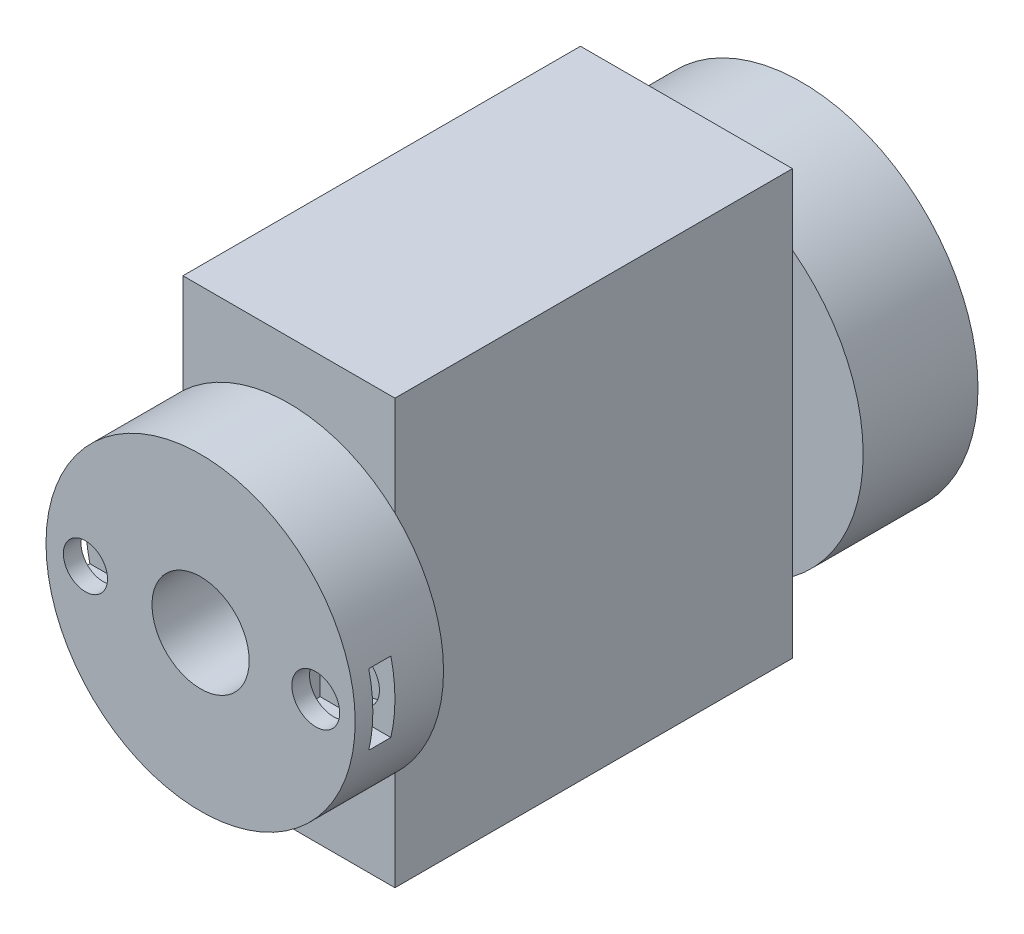
ISO-10303-21;
HEADER;
FILE_DESCRIPTION(('STEP AP214'),'2;1');
FILE_NAME('part.step','',(''),(''),'','','');
FILE_SCHEMA(('AUTOMOTIVE_DESIGN { 1 0 10303 214 1 1 1 1 }'));
ENDSEC;
DATA;
#1=APPLICATION_CONTEXT('core data for automotive mechanical design processes');
#2=APPLICATION_PROTOCOL_DEFINITION('international standard','automotive_design',2000,#1);
#3=PRODUCT_CONTEXT('',#1,'mechanical');
#4=PRODUCT('Part','Part','',(#3));
#5=PRODUCT_RELATED_PRODUCT_CATEGORY('part','',(#4));
#6=PRODUCT_DEFINITION_FORMATION('','',#4);
#7=PRODUCT_DEFINITION_CONTEXT('part definition',#1,'design');
#8=PRODUCT_DEFINITION('design','',#6,#7);
#9=PRODUCT_DEFINITION_SHAPE('','',#8);
#10=(LENGTH_UNIT() NAMED_UNIT(*) SI_UNIT(.MILLI.,.METRE.));
#11=(NAMED_UNIT(*) PLANE_ANGLE_UNIT() SI_UNIT($,.RADIAN.));
#12=(NAMED_UNIT(*) SI_UNIT($,.STERADIAN.) SOLID_ANGLE_UNIT());
#13=UNCERTAINTY_MEASURE_WITH_UNIT(LENGTH_MEASURE(1.E-05),#10,'distance_accuracy_value','');
#14=(GEOMETRIC_REPRESENTATION_CONTEXT(3) GLOBAL_UNCERTAINTY_ASSIGNED_CONTEXT((#13)) GLOBAL_UNIT_ASSIGNED_CONTEXT((#10,
#11,#12)) REPRESENTATION_CONTEXT('',''));
#15=CARTESIAN_POINT('',(0.,0.,0.));
#16=DIRECTION('',(0.,0.,1.));
#17=DIRECTION('',(1.,0.,0.));
#18=AXIS2_PLACEMENT_3D('',#15,#16,#17);
#19=CARTESIAN_POINT('',(0.,0.,-45.));
#20=DIRECTION('',(0.,0.,1.));
#21=DIRECTION('',(1.,0.,0.));
#22=AXIS2_PLACEMENT_3D('',#19,#20,#21);
#23=PLANE('',#22);
#24=CARTESIAN_POINT('',(0.,0.,-45.));
#25=DIRECTION('',(0.,0.,-1.));
#26=DIRECTION('',(-1.,0.,0.));
#27=AXIS2_PLACEMENT_3D('',#24,#25,#26);
#28=CIRCLE('',#27,20.);
#29=CARTESIAN_POINT('',(-12.,16.,-45.));
#30=VERTEX_POINT('',#29);
#31=CARTESIAN_POINT('',(12.,16.,-45.));
#32=VERTEX_POINT('',#31);
#33=EDGE_CURVE('E51',#30,#32,#28,.T.);
#34=ORIENTED_EDGE('',*,*,#33,.F.);
#35=DIRECTION('',(0.,1.,0.));
#36=VECTOR('',#35,1.);
#37=CARTESIAN_POINT('',(-12.,24.,-45.));
#38=LINE('',#37,#36);
#39=CARTESIAN_POINT('',(-12.,24.,-45.));
#40=VERTEX_POINT('',#39);
#41=EDGE_CURVE('E165',#30,#40,#38,.T.);
#42=ORIENTED_EDGE('',*,*,#41,.T.);
#43=DIRECTION('',(1.,0.,0.));
#44=VECTOR('',#43,1.);
#45=CARTESIAN_POINT('',(-12.,24.,-45.));
#46=LINE('',#45,#44);
#47=CARTESIAN_POINT('',(12.,24.,-45.));
#48=VERTEX_POINT('',#47);
#49=EDGE_CURVE('E162',#40,#48,#46,.T.);
#50=ORIENTED_EDGE('',*,*,#49,.T.);
#51=DIRECTION('',(0.,-1.,0.));
#52=VECTOR('',#51,1.);
#53=CARTESIAN_POINT('',(12.,24.,-45.));
#54=LINE('',#53,#52);
#55=EDGE_CURVE('E190',#48,#32,#54,.T.);
#56=ORIENTED_EDGE('',*,*,#55,.T.);
#57=EDGE_LOOP('',(#34,#42,#50,#56));
#58=FACE_BOUND('',#57,.T.);
#59=ADVANCED_FACE('F39',(#58),#23,.F.);
#60=CARTESIAN_POINT('',(0.,0.,0.));
#61=DIRECTION('',(0.,0.,1.));
#62=DIRECTION('',(1.,0.,0.));
#63=AXIS2_PLACEMENT_3D('',#60,#61,#62);
#64=PLANE('',#63);
#65=DIRECTION('',(0.,-1.,0.));
#66=VECTOR('',#65,1.);
#67=CARTESIAN_POINT('',(12.,24.,0.));
#68=LINE('',#67,#66);
#69=CARTESIAN_POINT('',(12.,12.737739202857,0.));
#70=VERTEX_POINT('',#69);
#71=CARTESIAN_POINT('',(12.,-12.737739202857,0.));
#72=VERTEX_POINT('',#71);
#73=EDGE_CURVE('E49',#70,#72,#68,.T.);
#74=ORIENTED_EDGE('',*,*,#73,.F.);
#75=CARTESIAN_POINT('',(0.,0.,0.));
#76=DIRECTION('',(0.,0.,1.));
#77=DIRECTION('',(1.,0.,0.));
#78=AXIS2_PLACEMENT_3D('',#75,#76,#77);
#79=CIRCLE('',#78,17.5);
#80=EDGE_CURVE('E319',#72,#70,#79,.T.);
#81=ORIENTED_EDGE('',*,*,#80,.F.);
#82=EDGE_LOOP('',(#74,#81));
#83=FACE_BOUND('',#82,.T.);
#84=ADVANCED_FACE('F401',(#83),#64,.F.);
#85=DIRECTION('',(0.,1.,0.));
#86=VECTOR('',#85,1.);
#87=CARTESIAN_POINT('',(-12.,24.,0.));
#88=LINE('',#87,#86);
#89=CARTESIAN_POINT('',(-12.,-12.737739202857,0.));
#90=VERTEX_POINT('',#89);
#91=CARTESIAN_POINT('',(-12.,12.737739202857,0.));
#92=VERTEX_POINT('',#91);
#93=EDGE_CURVE('E213',#90,#92,#88,.T.);
#94=ORIENTED_EDGE('',*,*,#93,.F.);
#95=EDGE_CURVE('E328',#92,#90,#79,.T.);
#96=ORIENTED_EDGE('',*,*,#95,.F.);
#97=EDGE_LOOP('',(#94,#96));
#98=FACE_BOUND('',#97,.T.);
#99=ADVANCED_FACE('F403',(#98),#64,.F.);
#100=CARTESIAN_POINT('',(13.0367250374008,0.,4.));
#101=DIRECTION('',(0.,0.,1.));
#102=DIRECTION('',(1.,0.,0.));
#103=AXIS2_PLACEMENT_3D('',#100,#101,#102);
#104=CYLINDRICAL_SURFACE('',#103,2.70753936126849);
#105=CARTESIAN_POINT('',(13.0367250374008,0.,8.));
#106=DIRECTION('',(0.,0.,-1.));
#107=DIRECTION('',(0.,1.,0.));
#108=AXIS2_PLACEMENT_3D('',#105,#106,#107);
#109=CIRCLE('',#108,2.70753936126849);
#110=CARTESIAN_POINT('',(13.0367250374008,2.70753936126848,8.));
#111=VERTEX_POINT('',#110);
#112=EDGE_CURVE('E246',#111,#111,#109,.T.);
#113=ORIENTED_EDGE('',*,*,#112,.T.);
#114=EDGE_LOOP('',(#113));
#115=FACE_BOUND('',#114,.T.);
#116=CARTESIAN_POINT('',(13.0367250374008,0.,10.));
#117=DIRECTION('',(0.,0.,1.));
#118=DIRECTION('',(1.,0.,0.));
#119=AXIS2_PLACEMENT_3D('',#116,#117,#118);
#120=CIRCLE('',#119,2.70753936126849);
#121=CARTESIAN_POINT('',(15.7442643986693,0.,10.));
#122=VERTEX_POINT('',#121);
#123=EDGE_CURVE('E235',#122,#122,#120,.T.);
#124=ORIENTED_EDGE('',*,*,#123,.T.);
#125=EDGE_LOOP('',(#124));
#126=FACE_BOUND('',#125,.T.);
#127=ADVANCED_FACE('F408',(#115,#126),#104,.F.);
#128=CARTESIAN_POINT('',(0.,0.,10.));
#129=DIRECTION('',(0.,0.,-1.));
#130=DIRECTION('',(-1.,0.,0.));
#131=AXIS2_PLACEMENT_3D('',#128,#129,#130);
#132=CYLINDRICAL_SURFACE('',#131,17.5);
#133=CARTESIAN_POINT('',(0.,0.,8.));
#134=DIRECTION('',(0.,0.,-1.));
#135=DIRECTION('',(0.,1.,0.));
#136=AXIS2_PLACEMENT_3D('',#133,#134,#135);
#137=CIRCLE('',#136,17.5);
#138=CARTESIAN_POINT('',(-17.0367250374008,-4.,8.));
#139=VERTEX_POINT('',#138);
#140=CARTESIAN_POINT('',(-17.0367250374008,4.,8.));
#141=VERTEX_POINT('',#140);
#142=EDGE_CURVE('E338',#139,#141,#137,.T.);
#143=ORIENTED_EDGE('',*,*,#142,.F.);
#144=DIRECTION('',(0.,0.,-1.));
#145=VECTOR('',#144,1.);
#146=CARTESIAN_POINT('',(-17.0367250374008,-4.,10.));
#147=LINE('',#146,#145);
#148=CARTESIAN_POINT('',(-17.0367250374008,-4.,5.5));
#149=VERTEX_POINT('',#148);
#150=EDGE_CURVE('E324',#149,#139,#147,.F.);
#151=ORIENTED_EDGE('',*,*,#150,.F.);
#152=CARTESIAN_POINT('',(0.,0.,5.5));
#153=DIRECTION('',(0.,0.,1.));
#154=DIRECTION('',(0.,-1.,0.));
#155=AXIS2_PLACEMENT_3D('',#152,#153,#154);
#156=CIRCLE('',#155,17.5);
#157=CARTESIAN_POINT('',(-17.0367250374008,4.,5.5));
#158=VERTEX_POINT('',#157);
#159=EDGE_CURVE('E331',#158,#149,#156,.T.);
#160=ORIENTED_EDGE('',*,*,#159,.F.);
#161=DIRECTION('',(0.,0.,-1.));
#162=VECTOR('',#161,1.);
#163=CARTESIAN_POINT('',(-17.0367250374008,4.,10.));
#164=LINE('',#163,#162);
#165=EDGE_CURVE('E335',#141,#158,#164,.T.);
#166=ORIENTED_EDGE('',*,*,#165,.F.);
#167=EDGE_LOOP('',(#143,#151,#160,#166));
#168=FACE_BOUND('',#167,.T.);
#169=CARTESIAN_POINT('',(0.,0.,10.));
#170=DIRECTION('',(0.,0.,1.));
#171=DIRECTION('',(1.,0.,0.));
#172=AXIS2_PLACEMENT_3D('',#169,#170,#171);
#173=CIRCLE('',#172,17.5);
#174=CARTESIAN_POINT('',(17.5,0.,10.));
#175=VERTEX_POINT('',#174);
#176=EDGE_CURVE('E320',#175,#175,#173,.T.);
#177=ORIENTED_EDGE('',*,*,#176,.F.);
#178=EDGE_LOOP('',(#177));
#179=FACE_BOUND('',#178,.T.);
#180=EDGE_CURVE('E325',#70,#92,#79,.T.);
#181=ORIENTED_EDGE('',*,*,#180,.T.);
#182=ORIENTED_EDGE('',*,*,#95,.T.);
#183=EDGE_CURVE('E391',#90,#72,#79,.T.);
#184=ORIENTED_EDGE('',*,*,#183,.T.);
#185=ORIENTED_EDGE('',*,*,#80,.T.);
#186=EDGE_LOOP('',(#181,#182,#184,#185));
#187=FACE_BOUND('',#186,.T.);
#188=CARTESIAN_POINT('',(0.,0.,8.));
#189=DIRECTION('',(0.,0.,-1.));
#190=DIRECTION('',(0.,1.,0.));
#191=AXIS2_PLACEMENT_3D('',#188,#189,#190);
#192=CIRCLE('',#191,17.5);
#193=CARTESIAN_POINT('',(17.0367250374008,4.,8.));
#194=VERTEX_POINT('',#193);
#195=CARTESIAN_POINT('',(17.0367250374008,-4.,8.));
#196=VERTEX_POINT('',#195);
#197=EDGE_CURVE('E353',#194,#196,#192,.T.);
#198=ORIENTED_EDGE('',*,*,#197,.F.);
#199=DIRECTION('',(0.,0.,-1.));
#200=VECTOR('',#199,1.);
#201=CARTESIAN_POINT('',(17.0367250374008,4.,10.));
#202=LINE('',#201,#200);
#203=CARTESIAN_POINT('',(17.0367250374008,4.,5.5));
#204=VERTEX_POINT('',#203);
#205=EDGE_CURVE('E341',#204,#194,#202,.F.);
#206=ORIENTED_EDGE('',*,*,#205,.F.);
#207=CARTESIAN_POINT('',(0.,0.,5.5));
#208=DIRECTION('',(0.,0.,1.));
#209=DIRECTION('',(0.,-1.,0.));
#210=AXIS2_PLACEMENT_3D('',#207,#208,#209);
#211=CIRCLE('',#210,17.5);
#212=CARTESIAN_POINT('',(17.0367250374008,-4.,5.5));
#213=VERTEX_POINT('',#212);
#214=EDGE_CURVE('E347',#213,#204,#211,.T.);
#215=ORIENTED_EDGE('',*,*,#214,.F.);
#216=DIRECTION('',(0.,0.,-1.));
#217=VECTOR('',#216,1.);
#218=CARTESIAN_POINT('',(17.0367250374008,-4.,10.));
#219=LINE('',#218,#217);
#220=EDGE_CURVE('E351',#196,#213,#219,.T.);
#221=ORIENTED_EDGE('',*,*,#220,.F.);
#222=EDGE_LOOP('',(#198,#206,#215,#221));
#223=FACE_BOUND('',#222,.T.);
#224=ADVANCED_FACE('F41',(#168,#179,#187,#223),#132,.T.);
#225=CARTESIAN_POINT('',(-13.0367250374008,0.,4.));
#226=DIRECTION('',(0.,0.,1.));
#227=DIRECTION('',(1.,0.,0.));
#228=AXIS2_PLACEMENT_3D('',#225,#226,#227);
#229=CYLINDRICAL_SURFACE('',#228,2.5);
#230=CARTESIAN_POINT('',(-13.0367250374008,0.,8.));
#231=DIRECTION('',(0.,0.,-1.));
#232=DIRECTION('',(0.,1.,0.));
#233=AXIS2_PLACEMENT_3D('',#230,#231,#232);
#234=CIRCLE('',#233,2.5);
#235=CARTESIAN_POINT('',(-13.0367250374008,2.5,8.));
#236=VERTEX_POINT('',#235);
#237=EDGE_CURVE('E287',#236,#236,#234,.T.);
#238=ORIENTED_EDGE('',*,*,#237,.T.);
#239=EDGE_LOOP('',(#238));
#240=FACE_BOUND('',#239,.T.);
#241=CARTESIAN_POINT('',(-13.0367250374008,0.,10.));
#242=DIRECTION('',(0.,0.,1.));
#243=DIRECTION('',(1.,0.,0.));
#244=AXIS2_PLACEMENT_3D('',#241,#242,#243);
#245=CIRCLE('',#244,2.5);
#246=CARTESIAN_POINT('',(-10.5367250374008,0.,10.));
#247=VERTEX_POINT('',#246);
#248=EDGE_CURVE('E278',#247,#247,#245,.T.);
#249=ORIENTED_EDGE('',*,*,#248,.T.);
#250=EDGE_LOOP('',(#249));
#251=FACE_BOUND('',#250,.T.);
#252=ADVANCED_FACE('F417',(#240,#251),#229,.F.);
#253=CARTESIAN_POINT('',(0.,0.,10.));
#254=DIRECTION('',(0.,0.,1.));
#255=DIRECTION('',(1.,0.,0.));
#256=AXIS2_PLACEMENT_3D('',#253,#254,#255);
#257=PLANE('',#256);
#258=CARTESIAN_POINT('',(0.,0.,10.));
#259=DIRECTION('',(0.,0.,1.));
#260=DIRECTION('',(1.,0.,0.));
#261=AXIS2_PLACEMENT_3D('',#258,#259,#260);
#262=CIRCLE('',#261,5.5);
#263=CARTESIAN_POINT('',(5.5,0.,10.));
#264=VERTEX_POINT('',#263);
#265=EDGE_CURVE('E230',#264,#264,#262,.T.);
#266=ORIENTED_EDGE('',*,*,#265,.F.);
#267=EDGE_LOOP('',(#266));
#268=FACE_BOUND('',#267,.T.);
#269=ORIENTED_EDGE('',*,*,#176,.T.);
#270=EDGE_LOOP('',(#269));
#271=FACE_BOUND('',#270,.T.);
#272=ORIENTED_EDGE('',*,*,#248,.F.);
#273=EDGE_LOOP('',(#272));
#274=FACE_BOUND('',#273,.T.);
#275=ORIENTED_EDGE('',*,*,#123,.F.);
#276=EDGE_LOOP('',(#275));
#277=FACE_BOUND('',#276,.T.);
#278=ADVANCED_FACE('F413',(#268,#271,#274,#277),#257,.T.);
#279=CARTESIAN_POINT('',(-18.0367250374008,4.,8.));
#280=DIRECTION('',(0.,0.,-1.));
#281=DIRECTION('',(0.,1.,0.));
#282=AXIS2_PLACEMENT_3D('',#279,#280,#281);
#283=PLANE('',#282);
#284=ORIENTED_EDGE('',*,*,#237,.F.);
#285=EDGE_LOOP('',(#284));
#286=FACE_BOUND('',#285,.T.);
#287=ORIENTED_EDGE('',*,*,#142,.T.);
#288=DIRECTION('',(1.,0.,0.));
#289=VECTOR('',#288,1.);
#290=CARTESIAN_POINT('',(-18.0367250374008,4.,8.));
#291=LINE('',#290,#289);
#292=CARTESIAN_POINT('',(-9.03672503740083,4.,8.));
#293=VERTEX_POINT('',#292);
#294=EDGE_CURVE('E316',#141,#293,#291,.T.);
#295=ORIENTED_EDGE('',*,*,#294,.T.);
#296=DIRECTION('',(0.,1.,0.));
#297=VECTOR('',#296,1.);
#298=CARTESIAN_POINT('',(-9.03672503740083,4.,8.));
#299=LINE('',#298,#297);
#300=CARTESIAN_POINT('',(-9.03672503740083,-4.,8.));
#301=VERTEX_POINT('',#300);
#302=EDGE_CURVE('E291',#301,#293,#299,.T.);
#303=ORIENTED_EDGE('',*,*,#302,.F.);
#304=DIRECTION('',(1.,0.,0.));
#305=VECTOR('',#304,1.);
#306=CARTESIAN_POINT('',(-18.0367250374008,-4.,8.));
#307=LINE('',#306,#305);
#308=EDGE_CURVE('E307',#139,#301,#307,.T.);
#309=ORIENTED_EDGE('',*,*,#308,.F.);
#310=EDGE_LOOP('',(#287,#295,#303,#309));
#311=FACE_BOUND('',#310,.T.);
#312=ADVANCED_FACE('F416',(#286,#311),#283,.T.);
#313=CARTESIAN_POINT('',(-18.0367250374008,4.,8.));
#314=DIRECTION('',(0.,-1.,0.));
#315=DIRECTION('',(1.,0.,0.));
#316=AXIS2_PLACEMENT_3D('',#313,#314,#315);
#317=PLANE('',#316);
#318=ORIENTED_EDGE('',*,*,#165,.T.);
#319=DIRECTION('',(1.,0.,0.));
#320=VECTOR('',#319,1.);
#321=CARTESIAN_POINT('',(-18.0367250374008,4.,5.5));
#322=LINE('',#321,#320);
#323=CARTESIAN_POINT('',(-9.03672503740083,4.,5.5));
#324=VERTEX_POINT('',#323);
#325=EDGE_CURVE('E313',#158,#324,#322,.T.);
#326=ORIENTED_EDGE('',*,*,#325,.T.);
#327=DIRECTION('',(0.,0.,-1.));
#328=VECTOR('',#327,1.);
#329=CARTESIAN_POINT('',(-9.03672503740083,4.,8.));
#330=LINE('',#329,#328);
#331=EDGE_CURVE('E295',#293,#324,#330,.T.);
#332=ORIENTED_EDGE('',*,*,#331,.F.);
#333=ORIENTED_EDGE('',*,*,#294,.F.);
#334=EDGE_LOOP('',(#318,#326,#332,#333));
#335=FACE_BOUND('',#334,.T.);
#336=ADVANCED_FACE('F421',(#335),#317,.T.);
#337=CARTESIAN_POINT('',(-18.0367250374008,4.,5.5));
#338=DIRECTION('',(0.,0.,1.));
#339=DIRECTION('',(0.,-1.,0.));
#340=AXIS2_PLACEMENT_3D('',#337,#338,#339);
#341=PLANE('',#340);
#342=CARTESIAN_POINT('',(-13.0367250374008,0.,5.5));
#343=DIRECTION('',(0.,0.,1.));
#344=DIRECTION('',(0.,-1.,0.));
#345=AXIS2_PLACEMENT_3D('',#342,#343,#344);
#346=CIRCLE('',#345,2.5);
#347=CARTESIAN_POINT('',(-13.0367250374008,-2.5,5.5));
#348=VERTEX_POINT('',#347);
#349=EDGE_CURVE('E286',#348,#348,#346,.T.);
#350=ORIENTED_EDGE('',*,*,#349,.F.);
#351=EDGE_LOOP('',(#350));
#352=FACE_BOUND('',#351,.T.);
#353=ORIENTED_EDGE('',*,*,#159,.T.);
#354=DIRECTION('',(1.,0.,0.));
#355=VECTOR('',#354,1.);
#356=CARTESIAN_POINT('',(-18.0367250374008,-4.,5.5));
#357=LINE('',#356,#355);
#358=CARTESIAN_POINT('',(-9.03672503740083,-4.,5.5));
#359=VERTEX_POINT('',#358);
#360=EDGE_CURVE('E310',#149,#359,#357,.T.);
#361=ORIENTED_EDGE('',*,*,#360,.T.);
#362=DIRECTION('',(0.,-1.,0.));
#363=VECTOR('',#362,1.);
#364=CARTESIAN_POINT('',(-9.03672503740083,4.,5.5));
#365=LINE('',#364,#363);
#366=EDGE_CURVE('E299',#324,#359,#365,.T.);
#367=ORIENTED_EDGE('',*,*,#366,.F.);
#368=ORIENTED_EDGE('',*,*,#325,.F.);
#369=EDGE_LOOP('',(#353,#361,#367,#368));
#370=FACE_BOUND('',#369,.T.);
#371=ADVANCED_FACE('F425',(#352,#370),#341,.T.);
#372=CARTESIAN_POINT('',(-18.0367250374008,-4.,8.));
#373=DIRECTION('',(0.,1.,0.));
#374=DIRECTION('',(-1.,0.,0.));
#375=AXIS2_PLACEMENT_3D('',#372,#373,#374);
#376=PLANE('',#375);
#377=ORIENTED_EDGE('',*,*,#150,.T.);
#378=ORIENTED_EDGE('',*,*,#308,.T.);
#379=DIRECTION('',(0.,0.,1.));
#380=VECTOR('',#379,1.);
#381=CARTESIAN_POINT('',(-9.03672503740083,-4.,8.));
#382=LINE('',#381,#380);
#383=EDGE_CURVE('E303',#359,#301,#382,.T.);
#384=ORIENTED_EDGE('',*,*,#383,.F.);
#385=ORIENTED_EDGE('',*,*,#360,.F.);
#386=EDGE_LOOP('',(#377,#378,#384,#385));
#387=FACE_BOUND('',#386,.T.);
#388=ADVANCED_FACE('F429',(#387),#376,.T.);
#389=CARTESIAN_POINT('',(-9.03672503740083,0.,0.));
#390=DIRECTION('',(1.,0.,0.));
#391=DIRECTION('',(0.,1.,0.));
#392=AXIS2_PLACEMENT_3D('',#389,#390,#391);
#393=PLANE('',#392);
#394=ORIENTED_EDGE('',*,*,#302,.T.);
#395=ORIENTED_EDGE('',*,*,#331,.T.);
#396=ORIENTED_EDGE('',*,*,#366,.T.);
#397=ORIENTED_EDGE('',*,*,#383,.T.);
#398=EDGE_LOOP('',(#394,#395,#396,#397));
#399=FACE_BOUND('',#398,.T.);
#400=ADVANCED_FACE('F433',(#399),#393,.F.);
#401=CARTESIAN_POINT('',(-13.0367250374008,0.,4.));
#402=DIRECTION('',(0.,0.,1.));
#403=DIRECTION('',(1.,0.,0.));
#404=AXIS2_PLACEMENT_3D('',#401,#402,#403);
#405=PLANE('',#404);
#406=CARTESIAN_POINT('',(-13.0367250374008,0.,4.));
#407=DIRECTION('',(0.,0.,1.));
#408=DIRECTION('',(1.,0.,0.));
#409=AXIS2_PLACEMENT_3D('',#406,#407,#408);
#410=CIRCLE('',#409,2.5);
#411=CARTESIAN_POINT('',(-10.5367250374008,0.,4.));
#412=VERTEX_POINT('',#411);
#413=EDGE_CURVE('E282',#412,#412,#410,.T.);
#414=ORIENTED_EDGE('',*,*,#413,.T.);
#415=EDGE_LOOP('',(#414));
#416=FACE_BOUND('',#415,.T.);
#417=ADVANCED_FACE('F437',(#416),#405,.T.);
#418=ORIENTED_EDGE('',*,*,#349,.T.);
#419=EDGE_LOOP('',(#418));
#420=FACE_BOUND('',#419,.T.);
#421=ORIENTED_EDGE('',*,*,#413,.F.);
#422=EDGE_LOOP('',(#421));
#423=FACE_BOUND('',#422,.T.);
#424=ADVANCED_FACE('F439',(#420,#423),#229,.F.);
#425=CARTESIAN_POINT('',(18.0367250374008,4.,8.));
#426=DIRECTION('',(0.,0.,-1.));
#427=DIRECTION('',(0.,1.,0.));
#428=AXIS2_PLACEMENT_3D('',#425,#426,#427);
#429=PLANE('',#428);
#430=ORIENTED_EDGE('',*,*,#112,.F.);
#431=EDGE_LOOP('',(#430));
#432=FACE_BOUND('',#431,.T.);
#433=ORIENTED_EDGE('',*,*,#197,.T.);
#434=DIRECTION('',(-1.,0.,0.));
#435=VECTOR('',#434,1.);
#436=CARTESIAN_POINT('',(18.0367250374008,-4.,8.));
#437=LINE('',#436,#435);
#438=CARTESIAN_POINT('',(9.03672503740083,-4.,8.));
#439=VERTEX_POINT('',#438);
#440=EDGE_CURVE('E275',#196,#439,#437,.T.);
#441=ORIENTED_EDGE('',*,*,#440,.T.);
#442=DIRECTION('',(0.,-1.,0.));
#443=VECTOR('',#442,1.);
#444=CARTESIAN_POINT('',(9.03672503740083,4.,8.));
#445=LINE('',#444,#443);
#446=CARTESIAN_POINT('',(9.03672503740083,4.,8.));
#447=VERTEX_POINT('',#446);
#448=EDGE_CURVE('E250',#447,#439,#445,.T.);
#449=ORIENTED_EDGE('',*,*,#448,.F.);
#450=DIRECTION('',(-1.,0.,0.));
#451=VECTOR('',#450,1.);
#452=CARTESIAN_POINT('',(18.0367250374008,4.,8.));
#453=LINE('',#452,#451);
#454=EDGE_CURVE('E266',#194,#447,#453,.T.);
#455=ORIENTED_EDGE('',*,*,#454,.F.);
#456=EDGE_LOOP('',(#433,#441,#449,#455));
#457=FACE_BOUND('',#456,.T.);
#458=ADVANCED_FACE('F442',(#432,#457),#429,.T.);
#459=CARTESIAN_POINT('',(18.0367250374008,-4.,8.));
#460=DIRECTION('',(0.,1.,0.));
#461=DIRECTION('',(-1.,0.,0.));
#462=AXIS2_PLACEMENT_3D('',#459,#460,#461);
#463=PLANE('',#462);
#464=ORIENTED_EDGE('',*,*,#220,.T.);
#465=DIRECTION('',(-1.,0.,0.));
#466=VECTOR('',#465,1.);
#467=CARTESIAN_POINT('',(18.0367250374008,-4.,5.5));
#468=LINE('',#467,#466);
#469=CARTESIAN_POINT('',(9.03672503740083,-4.,5.5));
#470=VERTEX_POINT('',#469);
#471=EDGE_CURVE('E272',#213,#470,#468,.T.);
#472=ORIENTED_EDGE('',*,*,#471,.T.);
#473=DIRECTION('',(0.,0.,-1.));
#474=VECTOR('',#473,1.);
#475=CARTESIAN_POINT('',(9.03672503740083,-4.,8.));
#476=LINE('',#475,#474);
#477=EDGE_CURVE('E254',#439,#470,#476,.T.);
#478=ORIENTED_EDGE('',*,*,#477,.F.);
#479=ORIENTED_EDGE('',*,*,#440,.F.);
#480=EDGE_LOOP('',(#464,#472,#478,#479));
#481=FACE_BOUND('',#480,.T.);
#482=ADVANCED_FACE('F449',(#481),#463,.T.);
#483=CARTESIAN_POINT('',(18.0367250374008,4.,5.5));
#484=DIRECTION('',(0.,0.,1.));
#485=DIRECTION('',(0.,-1.,0.));
#486=AXIS2_PLACEMENT_3D('',#483,#484,#485);
#487=PLANE('',#486);
#488=CARTESIAN_POINT('',(13.0367250374008,0.,5.5));
#489=DIRECTION('',(0.,0.,1.));
#490=DIRECTION('',(0.,-1.,0.));
#491=AXIS2_PLACEMENT_3D('',#488,#489,#490);
#492=CIRCLE('',#491,2.70753936126849);
#493=CARTESIAN_POINT('',(13.0367250374008,-2.70753936126849,5.5));
#494=VERTEX_POINT('',#493);
#495=EDGE_CURVE('E43',#494,#494,#492,.T.);
#496=ORIENTED_EDGE('',*,*,#495,.F.);
#497=EDGE_LOOP('',(#496));
#498=FACE_BOUND('',#497,.T.);
#499=ORIENTED_EDGE('',*,*,#214,.T.);
#500=DIRECTION('',(-1.,0.,0.));
#501=VECTOR('',#500,1.);
#502=CARTESIAN_POINT('',(18.0367250374008,4.,5.5));
#503=LINE('',#502,#501);
#504=CARTESIAN_POINT('',(9.03672503740083,4.,5.5));
#505=VERTEX_POINT('',#504);
#506=EDGE_CURVE('E269',#204,#505,#503,.T.);
#507=ORIENTED_EDGE('',*,*,#506,.T.);
#508=DIRECTION('',(0.,1.,0.));
#509=VECTOR('',#508,1.);
#510=CARTESIAN_POINT('',(9.03672503740083,4.,5.5));
#511=LINE('',#510,#509);
#512=EDGE_CURVE('E258',#470,#505,#511,.T.);
#513=ORIENTED_EDGE('',*,*,#512,.F.);
#514=ORIENTED_EDGE('',*,*,#471,.F.);
#515=EDGE_LOOP('',(#499,#507,#513,#514));
#516=FACE_BOUND('',#515,.T.);
#517=ADVANCED_FACE('F453',(#498,#516),#487,.T.);
#518=CARTESIAN_POINT('',(18.0367250374008,4.,8.));
#519=DIRECTION('',(0.,-1.,0.));
#520=DIRECTION('',(1.,0.,0.));
#521=AXIS2_PLACEMENT_3D('',#518,#519,#520);
#522=PLANE('',#521);
#523=ORIENTED_EDGE('',*,*,#205,.T.);
#524=ORIENTED_EDGE('',*,*,#454,.T.);
#525=DIRECTION('',(0.,0.,1.));
#526=VECTOR('',#525,1.);
#527=CARTESIAN_POINT('',(9.03672503740083,4.,8.));
#528=LINE('',#527,#526);
#529=EDGE_CURVE('E262',#505,#447,#528,.T.);
#530=ORIENTED_EDGE('',*,*,#529,.F.);
#531=ORIENTED_EDGE('',*,*,#506,.F.);
#532=EDGE_LOOP('',(#523,#524,#530,#531));
#533=FACE_BOUND('',#532,.T.);
#534=ADVANCED_FACE('F457',(#533),#522,.T.);
#535=CARTESIAN_POINT('',(9.03672503740083,0.,0.));
#536=DIRECTION('',(1.,0.,0.));
#537=DIRECTION('',(0.,1.,0.));
#538=AXIS2_PLACEMENT_3D('',#535,#536,#537);
#539=PLANE('',#538);
#540=ORIENTED_EDGE('',*,*,#448,.T.);
#541=ORIENTED_EDGE('',*,*,#477,.T.);
#542=ORIENTED_EDGE('',*,*,#512,.T.);
#543=ORIENTED_EDGE('',*,*,#529,.T.);
#544=EDGE_LOOP('',(#540,#541,#542,#543));
#545=FACE_BOUND('',#544,.T.);
#546=ADVANCED_FACE('F461',(#545),#539,.T.);
#547=CARTESIAN_POINT('',(13.0367250374008,0.,4.));
#548=DIRECTION('',(0.,0.,1.));
#549=DIRECTION('',(1.,0.,0.));
#550=AXIS2_PLACEMENT_3D('',#547,#548,#549);
#551=PLANE('',#550);
#552=CARTESIAN_POINT('',(13.0367250374008,0.,4.));
#553=DIRECTION('',(0.,0.,1.));
#554=DIRECTION('',(1.,0.,0.));
#555=AXIS2_PLACEMENT_3D('',#552,#553,#554);
#556=CIRCLE('',#555,2.70753936126849);
#557=CARTESIAN_POINT('',(15.7442643986693,0.,4.));
#558=VERTEX_POINT('',#557);
#559=EDGE_CURVE('E242',#558,#558,#556,.T.);
#560=ORIENTED_EDGE('',*,*,#559,.T.);
#561=EDGE_LOOP('',(#560));
#562=FACE_BOUND('',#561,.T.);
#563=ADVANCED_FACE('F465',(#562),#551,.T.);
#564=ORIENTED_EDGE('',*,*,#495,.T.);
#565=EDGE_LOOP('',(#564));
#566=FACE_BOUND('',#565,.T.);
#567=ORIENTED_EDGE('',*,*,#559,.F.);
#568=EDGE_LOOP('',(#567));
#569=FACE_BOUND('',#568,.T.);
#570=ADVANCED_FACE('F467',(#566,#569),#104,.F.);
#571=CARTESIAN_POINT('',(0.,0.,0.));
#572=DIRECTION('',(0.,0.,1.));
#573=DIRECTION('',(1.,0.,0.));
#574=AXIS2_PLACEMENT_3D('',#571,#572,#573);
#575=CYLINDRICAL_SURFACE('',#574,5.5);
#576=CARTESIAN_POINT('',(0.,0.,0.));
#577=DIRECTION('',(0.,0.,1.));
#578=DIRECTION('',(1.,0.,0.));
#579=AXIS2_PLACEMENT_3D('',#576,#577,#578);
#580=CIRCLE('',#579,5.5);
#581=CARTESIAN_POINT('',(5.5,0.,0.));
#582=VERTEX_POINT('',#581);
#583=EDGE_CURVE('E231',#582,#582,#580,.T.);
#584=ORIENTED_EDGE('',*,*,#583,.F.);
#585=EDGE_LOOP('',(#584));
#586=FACE_BOUND('',#585,.T.);
#587=ORIENTED_EDGE('',*,*,#265,.T.);
#588=EDGE_LOOP('',(#587));
#589=FACE_BOUND('',#588,.T.);
#590=ADVANCED_FACE('F470',(#586,#589),#575,.F.);
#591=CARTESIAN_POINT('',(12.,-16.,-45.));
#592=VERTEX_POINT('',#591);
#593=CARTESIAN_POINT('',(-12.,-16.,-45.));
#594=VERTEX_POINT('',#593);
#595=EDGE_CURVE('E11',#592,#594,#28,.T.);
#596=ORIENTED_EDGE('',*,*,#595,.F.);
#597=CARTESIAN_POINT('',(12.,-24.,-45.));
#598=VERTEX_POINT('',#597);
#599=EDGE_CURVE('E194',#592,#598,#54,.T.);
#600=ORIENTED_EDGE('',*,*,#599,.T.);
#601=DIRECTION('',(-1.,0.,0.));
#602=VECTOR('',#601,1.);
#603=CARTESIAN_POINT('',(-12.,-24.,-45.));
#604=LINE('',#603,#602);
#605=CARTESIAN_POINT('',(-12.,-24.,-45.));
#606=VERTEX_POINT('',#605);
#607=EDGE_CURVE('E157',#598,#606,#604,.T.);
#608=ORIENTED_EDGE('',*,*,#607,.T.);
#609=EDGE_CURVE('E153',#606,#594,#38,.T.);
#610=ORIENTED_EDGE('',*,*,#609,.T.);
#611=EDGE_LOOP('',(#596,#600,#608,#610));
#612=FACE_BOUND('',#611,.T.);
#613=ADVANCED_FACE('F155',(#612),#23,.F.);
#614=CARTESIAN_POINT('',(-12.,24.,-45.));
#615=DIRECTION('',(0.,-1.,0.));
#616=DIRECTION('',(1.,0.,0.));
#617=AXIS2_PLACEMENT_3D('',#614,#615,#616);
#618=PLANE('',#617);
#619=DIRECTION('',(1.,0.,0.));
#620=VECTOR('',#619,1.);
#621=CARTESIAN_POINT('',(-12.,24.,0.));
#622=LINE('',#621,#620);
#623=CARTESIAN_POINT('',(-12.,24.,0.));
#624=VERTEX_POINT('',#623);
#625=CARTESIAN_POINT('',(12.,24.,0.));
#626=VERTEX_POINT('',#625);
#627=EDGE_CURVE('E212',#624,#626,#622,.T.);
#628=ORIENTED_EDGE('',*,*,#627,.T.);
#629=DIRECTION('',(0.,0.,1.));
#630=VECTOR('',#629,1.);
#631=CARTESIAN_POINT('',(12.,24.,-45.));
#632=LINE('',#631,#630);
#633=EDGE_CURVE('E199',#48,#626,#632,.T.);
#634=ORIENTED_EDGE('',*,*,#633,.F.);
#635=ORIENTED_EDGE('',*,*,#49,.F.);
#636=DIRECTION('',(0.,0.,1.));
#637=VECTOR('',#636,1.);
#638=CARTESIAN_POINT('',(-12.,24.,-45.));
#639=LINE('',#638,#637);
#640=EDGE_CURVE('E219',#40,#624,#639,.T.);
#641=ORIENTED_EDGE('',*,*,#640,.T.);
#642=EDGE_LOOP('',(#628,#634,#635,#641));
#643=FACE_BOUND('',#642,.T.);
#644=ADVANCED_FACE('F370',(#643),#618,.F.);
#645=CARTESIAN_POINT('',(-12.,24.,-45.));
#646=DIRECTION('',(1.,0.,0.));
#647=DIRECTION('',(0.,1.,0.));
#648=AXIS2_PLACEMENT_3D('',#645,#646,#647);
#649=PLANE('',#648);
#650=CARTESIAN_POINT('',(-12.,-24.,0.));
#651=VERTEX_POINT('',#650);
#652=EDGE_CURVE('E209',#651,#90,#88,.T.);
#653=ORIENTED_EDGE('',*,*,#652,.T.);
#654=ORIENTED_EDGE('',*,*,#93,.T.);
#655=EDGE_CURVE('E208',#92,#624,#88,.T.);
#656=ORIENTED_EDGE('',*,*,#655,.T.);
#657=ORIENTED_EDGE('',*,*,#640,.F.);
#658=ORIENTED_EDGE('',*,*,#41,.F.);
#659=EDGE_CURVE('E163',#594,#30,#38,.T.);
#660=ORIENTED_EDGE('',*,*,#659,.F.);
#661=ORIENTED_EDGE('',*,*,#609,.F.);
#662=DIRECTION('',(0.,0.,1.));
#663=VECTOR('',#662,1.);
#664=CARTESIAN_POINT('',(-12.,-24.,-45.));
#665=LINE('',#664,#663);
#666=EDGE_CURVE('E223',#606,#651,#665,.T.);
#667=ORIENTED_EDGE('',*,*,#666,.T.);
#668=EDGE_LOOP('',(#653,#654,#656,#657,#658,#660,#661,#667));
#669=FACE_BOUND('',#668,.T.);
#670=ADVANCED_FACE('F169',(#669),#649,.F.);
#671=CARTESIAN_POINT('',(-12.,-24.,-45.));
#672=DIRECTION('',(0.,1.,0.));
#673=DIRECTION('',(-1.,0.,0.));
#674=AXIS2_PLACEMENT_3D('',#671,#672,#673);
#675=PLANE('',#674);
#676=DIRECTION('',(-1.,0.,0.));
#677=VECTOR('',#676,1.);
#678=CARTESIAN_POINT('',(-12.,-24.,0.));
#679=LINE('',#678,#677);
#680=CARTESIAN_POINT('',(12.,-24.,0.));
#681=VERTEX_POINT('',#680);
#682=EDGE_CURVE('E204',#681,#651,#679,.T.);
#683=ORIENTED_EDGE('',*,*,#682,.T.);
#684=ORIENTED_EDGE('',*,*,#666,.F.);
#685=ORIENTED_EDGE('',*,*,#607,.F.);
#686=DIRECTION('',(0.,0.,1.));
#687=VECTOR('',#686,1.);
#688=CARTESIAN_POINT('',(12.,-24.,-45.));
#689=LINE('',#688,#687);
#690=EDGE_CURVE('E226',#598,#681,#689,.T.);
#691=ORIENTED_EDGE('',*,*,#690,.T.);
#692=EDGE_LOOP('',(#683,#684,#685,#691));
#693=FACE_BOUND('',#692,.T.);
#694=ADVANCED_FACE('F382',(#693),#675,.F.);
#695=CARTESIAN_POINT('',(12.,24.,-45.));
#696=DIRECTION('',(-1.,0.,0.));
#697=DIRECTION('',(0.,-1.,0.));
#698=AXIS2_PLACEMENT_3D('',#695,#696,#697);
#699=PLANE('',#698);
#700=EDGE_CURVE('E200',#626,#70,#68,.T.);
#701=ORIENTED_EDGE('',*,*,#700,.T.);
#702=ORIENTED_EDGE('',*,*,#73,.T.);
#703=EDGE_CURVE('E205',#72,#681,#68,.T.);
#704=ORIENTED_EDGE('',*,*,#703,.T.);
#705=ORIENTED_EDGE('',*,*,#690,.F.);
#706=ORIENTED_EDGE('',*,*,#599,.F.);
#707=EDGE_CURVE('E193',#32,#592,#54,.T.);
#708=ORIENTED_EDGE('',*,*,#707,.F.);
#709=ORIENTED_EDGE('',*,*,#55,.F.);
#710=ORIENTED_EDGE('',*,*,#633,.T.);
#711=EDGE_LOOP('',(#701,#702,#704,#705,#706,#708,#709,#710));
#712=FACE_BOUND('',#711,.T.);
#713=ADVANCED_FACE('F375',(#712),#699,.F.);
#714=CARTESIAN_POINT('',(0.,0.,0.));
#715=DIRECTION('',(0.,0.,1.));
#716=DIRECTION('',(1.,0.,0.));
#717=AXIS2_PLACEMENT_3D('',#714,#715,#716);
#718=PLANE('',#717);
#719=ORIENTED_EDGE('',*,*,#183,.F.);
#720=ORIENTED_EDGE('',*,*,#652,.F.);
#721=ORIENTED_EDGE('',*,*,#682,.F.);
#722=ORIENTED_EDGE('',*,*,#703,.F.);
#723=EDGE_LOOP('',(#719,#720,#721,#722));
#724=FACE_BOUND('',#723,.T.);
#725=ADVANCED_FACE('F389',(#724),#718,.T.);
#726=ORIENTED_EDGE('',*,*,#180,.F.);
#727=ORIENTED_EDGE('',*,*,#700,.F.);
#728=ORIENTED_EDGE('',*,*,#627,.F.);
#729=ORIENTED_EDGE('',*,*,#655,.F.);
#730=EDGE_LOOP('',(#726,#727,#728,#729));
#731=FACE_BOUND('',#730,.T.);
#732=ADVANCED_FACE('F373',(#731),#718,.T.);
#733=ORIENTED_EDGE('',*,*,#583,.T.);
#734=EDGE_LOOP('',(#733));
#735=FACE_BOUND('',#734,.T.);
#736=ADVANCED_FACE('F486',(#735),#718,.T.);
#737=CARTESIAN_POINT('',(0.,0.,-45.));
#738=DIRECTION('',(0.,0.,-1.));
#739=DIRECTION('',(-1.,0.,0.));
#740=AXIS2_PLACEMENT_3D('',#737,#738,#739);
#741=PLANE('',#740);
#742=EDGE_CURVE('E52',#32,#592,#28,.T.);
#743=ORIENTED_EDGE('',*,*,#742,.F.);
#744=ORIENTED_EDGE('',*,*,#707,.T.);
#745=EDGE_LOOP('',(#743,#744));
#746=FACE_BOUND('',#745,.T.);
#747=ADVANCED_FACE('F488',(#746),#741,.F.);
#748=EDGE_CURVE('E174',#594,#30,#28,.T.);
#749=ORIENTED_EDGE('',*,*,#748,.F.);
#750=ORIENTED_EDGE('',*,*,#659,.T.);
#751=EDGE_LOOP('',(#749,#750));
#752=FACE_BOUND('',#751,.T.);
#753=ADVANCED_FACE('F175',(#752),#741,.F.);
#754=CARTESIAN_POINT('',(0.,0.,-58.));
#755=DIRECTION('',(0.,0.,1.));
#756=DIRECTION('',(1.,0.,0.));
#757=AXIS2_PLACEMENT_3D('',#754,#755,#756);
#758=CYLINDRICAL_SURFACE('',#757,20.);
#759=CARTESIAN_POINT('',(0.,0.,-58.));
#760=DIRECTION('',(0.,0.,-1.));
#761=DIRECTION('',(-1.,0.,0.));
#762=AXIS2_PLACEMENT_3D('',#759,#760,#761);
#763=CIRCLE('',#762,20.);
#764=CARTESIAN_POINT('',(-20.,0.,-58.));
#765=VERTEX_POINT('',#764);
#766=EDGE_CURVE('E186',#765,#765,#763,.T.);
#767=ORIENTED_EDGE('',*,*,#766,.F.);
#768=EDGE_LOOP('',(#767));
#769=FACE_BOUND('',#768,.T.);
#770=ORIENTED_EDGE('',*,*,#33,.T.);
#771=ORIENTED_EDGE('',*,*,#742,.T.);
#772=ORIENTED_EDGE('',*,*,#595,.T.);
#773=ORIENTED_EDGE('',*,*,#748,.T.);
#774=EDGE_LOOP('',(#770,#771,#772,#773));
#775=FACE_BOUND('',#774,.T.);
#776=ADVANCED_FACE('F180',(#769,#775),#758,.T.);
#777=CARTESIAN_POINT('',(0.,0.,-58.));
#778=DIRECTION('',(0.,0.,-1.));
#779=DIRECTION('',(-1.,0.,0.));
#780=AXIS2_PLACEMENT_3D('',#777,#778,#779);
#781=PLANE('',#780);
#782=CARTESIAN_POINT('',(0.,0.,-58.));
#783=DIRECTION('',(0.,0.,-1.));
#784=DIRECTION('',(-1.,0.,0.));
#785=AXIS2_PLACEMENT_3D('',#782,#783,#784);
#786=CIRCLE('',#785,11.5);
#787=CARTESIAN_POINT('',(-11.5,0.,-58.));
#788=VERTEX_POINT('',#787);
#789=EDGE_CURVE('E513',#788,#788,#786,.T.);
#790=ORIENTED_EDGE('',*,*,#789,.F.);
#791=EDGE_LOOP('',(#790));
#792=FACE_BOUND('',#791,.T.);
#793=ORIENTED_EDGE('',*,*,#766,.T.);
#794=EDGE_LOOP('',(#793));
#795=FACE_BOUND('',#794,.T.);
#796=ADVANCED_FACE('F494',(#792,#795),#781,.T.);
#797=CARTESIAN_POINT('',(0.,0.,-50.));
#798=DIRECTION('',(0.,0.,-1.));
#799=DIRECTION('',(-1.,0.,0.));
#800=AXIS2_PLACEMENT_3D('',#797,#798,#799);
#801=CYLINDRICAL_SURFACE('',#800,11.5);
#802=CARTESIAN_POINT('',(0.,0.,-50.));
#803=DIRECTION('',(0.,0.,-1.));
#804=DIRECTION('',(-1.,0.,0.));
#805=AXIS2_PLACEMENT_3D('',#802,#803,#804);
#806=CIRCLE('',#805,11.5);
#807=CARTESIAN_POINT('',(-11.5,0.,-50.));
#808=VERTEX_POINT('',#807);
#809=EDGE_CURVE('E178',#808,#808,#806,.T.);
#810=ORIENTED_EDGE('',*,*,#809,.F.);
#811=EDGE_LOOP('',(#810));
#812=FACE_BOUND('',#811,.T.);
#813=ORIENTED_EDGE('',*,*,#789,.T.);
#814=EDGE_LOOP('',(#813));
#815=FACE_BOUND('',#814,.T.);
#816=ADVANCED_FACE('F500',(#812,#815),#801,.F.);
#817=CARTESIAN_POINT('',(0.,0.,-50.));
#818=DIRECTION('',(0.,0.,-1.));
#819=DIRECTION('',(-1.,0.,0.));
#820=AXIS2_PLACEMENT_3D('',#817,#818,#819);
#821=PLANE('',#820);
#822=ORIENTED_EDGE('',*,*,#809,.T.);
#823=EDGE_LOOP('',(#822));
#824=FACE_BOUND('',#823,.T.);
#825=ADVANCED_FACE('F504',(#824),#821,.T.);
#826=CLOSED_SHELL('',(#59,#84,#99,#127,#224,#252,#278,#312,#336,#371,#388,#400,#417,#424,#458,
#482,#517,#534,#546,#563,#570,#590,#613,#644,#670,#694,#713,#725,#732,#736,#747,#753,#776,#796,
#816,#825));
#827=MANIFOLD_SOLID_BREP('B2',#826);
#828=ADVANCED_BREP_SHAPE_REPRESENTATION('',(#18,#827),#14);
#829=SHAPE_DEFINITION_REPRESENTATION(#9,#828);
ENDSEC;
END-ISO-10303-21;
